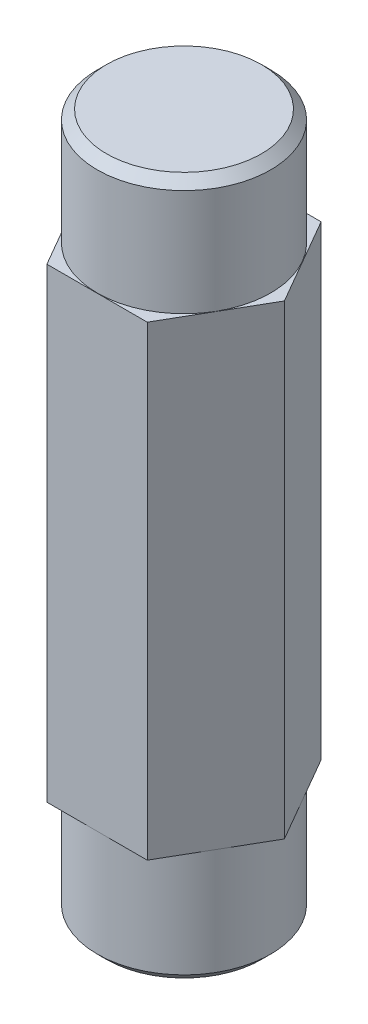
ISO-10303-21;
HEADER;
FILE_DESCRIPTION(('STEP AP214'),'2;1');
FILE_NAME('part.step','',(''),(''),'','','');
FILE_SCHEMA(('AUTOMOTIVE_DESIGN { 1 0 10303 214 1 1 1 1 }'));
ENDSEC;
DATA;
#1=APPLICATION_CONTEXT('core data for automotive mechanical design processes');
#2=APPLICATION_PROTOCOL_DEFINITION('international standard','automotive_design',2000,#1);
#3=PRODUCT_CONTEXT('',#1,'mechanical');
#4=PRODUCT('Part','Part','',(#3));
#5=PRODUCT_RELATED_PRODUCT_CATEGORY('part','',(#4));
#6=PRODUCT_DEFINITION_FORMATION('','',#4);
#7=PRODUCT_DEFINITION_CONTEXT('part definition',#1,'design');
#8=PRODUCT_DEFINITION('design','',#6,#7);
#9=PRODUCT_DEFINITION_SHAPE('','',#8);
#10=(LENGTH_UNIT() NAMED_UNIT(*) SI_UNIT(.MILLI.,.METRE.));
#11=(NAMED_UNIT(*) PLANE_ANGLE_UNIT() SI_UNIT($,.RADIAN.));
#12=(NAMED_UNIT(*) SI_UNIT($,.STERADIAN.) SOLID_ANGLE_UNIT());
#13=UNCERTAINTY_MEASURE_WITH_UNIT(LENGTH_MEASURE(1.E-05),#10,'distance_accuracy_value','');
#14=(GEOMETRIC_REPRESENTATION_CONTEXT(3) GLOBAL_UNCERTAINTY_ASSIGNED_CONTEXT((#13)) GLOBAL_UNIT_ASSIGNED_CONTEXT((#10,
#11,#12)) REPRESENTATION_CONTEXT('',''));
#15=CARTESIAN_POINT('',(0.,0.,0.));
#16=DIRECTION('',(0.,0.,1.));
#17=DIRECTION('',(1.,0.,0.));
#18=AXIS2_PLACEMENT_3D('',#15,#16,#17);
#19=CARTESIAN_POINT('',(-39.2241243202131,6.35,-16.6661167863655));
#20=DIRECTION('',(0.,-1.,0.));
#21=DIRECTION('',(0.,0.,-1.));
#22=AXIS2_PLACEMENT_3D('',#19,#20,#21);
#23=PLANE('',#22);
#24=CARTESIAN_POINT('',(-39.2241243202131,6.35000000039554,-16.6661167863655));
#25=DIRECTION('',(0.,-1.,0.));
#26=DIRECTION('',(0.,0.,-1.));
#27=AXIS2_PLACEMENT_3D('',#24,#25,#26);
#28=CIRCLE('',#27,4.24180000045985);
#29=CARTESIAN_POINT('',(-39.2241243202131,6.35000000039554,-20.9079167868254));
#30=VERTEX_POINT('',#29);
#31=EDGE_CURVE('E20',#30,#30,#28,.T.);
#32=ORIENTED_EDGE('',*,*,#31,.F.);
#33=EDGE_LOOP('',(#32));
#34=FACE_BOUND('',#33,.T.);
#35=ADVANCED_FACE('F17',(#34),#23,.F.);
#36=CARTESIAN_POINT('',(-39.2241243202131,5.84199999997281,-16.6661167863655));
#37=DIRECTION('',(0.,-1.,0.));
#38=DIRECTION('',(0.,0.,-1.));
#39=AXIS2_PLACEMENT_3D('',#36,#37,#38);
#40=CONICAL_SURFACE('',#39,4.74979999997309,0.785398162502276);
#41=ORIENTED_EDGE('',*,*,#31,.T.);
#42=EDGE_LOOP('',(#41));
#43=FACE_BOUND('',#42,.T.);
#44=CARTESIAN_POINT('',(-39.2241243202131,5.842,-16.6661167863655));
#45=DIRECTION('',(0.,1.,0.));
#46=DIRECTION('',(0.,0.,1.));
#47=AXIS2_PLACEMENT_3D('',#44,#45,#46);
#48=CIRCLE('',#47,4.7498);
#49=CARTESIAN_POINT('',(-39.2241243202131,5.842,-11.9163167863655));
#50=VERTEX_POINT('',#49);
#51=EDGE_CURVE('E97',#50,#50,#48,.F.);
#52=ORIENTED_EDGE('',*,*,#51,.F.);
#53=EDGE_LOOP('',(#52));
#54=FACE_BOUND('',#53,.T.);
#55=ADVANCED_FACE('F121',(#43,#54),#40,.T.);
#56=CARTESIAN_POINT('',(-39.2241243202131,6.35,-16.6661167863655));
#57=DIRECTION('',(0.,1.,0.));
#58=DIRECTION('',(0.,0.,1.));
#59=AXIS2_PLACEMENT_3D('',#56,#57,#58);
#60=CYLINDRICAL_SURFACE('',#59,4.7498);
#61=CARTESIAN_POINT('',(-39.2241243202131,0.,-16.6661167863655));
#62=DIRECTION('',(0.,1.,0.));
#63=DIRECTION('',(0.,0.,1.));
#64=AXIS2_PLACEMENT_3D('',#61,#62,#63);
#65=CIRCLE('',#64,4.7498);
#66=CARTESIAN_POINT('',(-39.2241243202131,0.,-11.9163167863655));
#67=VERTEX_POINT('',#66);
#68=EDGE_CURVE('E86',#67,#67,#65,.T.);
#69=ORIENTED_EDGE('',*,*,#68,.T.);
#70=EDGE_LOOP('',(#69));
#71=FACE_BOUND('',#70,.T.);
#72=ORIENTED_EDGE('',*,*,#51,.T.);
#73=EDGE_LOOP('',(#72));
#74=FACE_BOUND('',#73,.T.);
#75=ADVANCED_FACE('F108',(#71,#74),#60,.T.);
#76=CARTESIAN_POINT('',(-44.7233856342443,0.,-16.6661167863655));
#77=DIRECTION('',(0.,-1.,0.));
#78=DIRECTION('',(0.,0.,-1.));
#79=AXIS2_PLACEMENT_3D('',#76,#77,#78);
#80=PLANE('',#79);
#81=ORIENTED_EDGE('',*,*,#68,.F.);
#82=EDGE_LOOP('',(#81));
#83=FACE_BOUND('',#82,.T.);
#84=DIRECTION('',(1.,0.,0.));
#85=VECTOR('',#84,1.);
#86=CARTESIAN_POINT('',(-41.9737549772287,0.,-11.9036167863655));
#87=LINE('',#86,#85);
#88=CARTESIAN_POINT('',(-36.4744936631975,0.,-11.9036167863655));
#89=VERTEX_POINT('',#88);
#90=CARTESIAN_POINT('',(-41.9737549772287,0.,-11.9036167863655));
#91=VERTEX_POINT('',#90);
#92=EDGE_CURVE('E270',#89,#91,#87,.F.);
#93=ORIENTED_EDGE('',*,*,#92,.F.);
#94=DIRECTION('',(0.500000000000001,0.,-0.866025403784438));
#95=VECTOR('',#94,1.);
#96=CARTESIAN_POINT('',(-36.4744936631975,0.,-11.9036167863655));
#97=LINE('',#96,#95);
#98=CARTESIAN_POINT('',(-33.7248630061819,0.,-16.6661167863655));
#99=VERTEX_POINT('',#98);
#100=EDGE_CURVE('E275',#99,#89,#97,.F.);
#101=ORIENTED_EDGE('',*,*,#100,.F.);
#102=DIRECTION('',(-0.5,0.,-0.866025403784439));
#103=VECTOR('',#102,1.);
#104=CARTESIAN_POINT('',(-33.7248630061819,0.,-16.6661167863655));
#105=LINE('',#104,#103);
#106=CARTESIAN_POINT('',(-36.4744936631975,0.,-21.4286167863655));
#107=VERTEX_POINT('',#106);
#108=EDGE_CURVE('E278',#107,#99,#105,.F.);
#109=ORIENTED_EDGE('',*,*,#108,.F.);
#110=DIRECTION('',(-1.,0.,0.));
#111=VECTOR('',#110,1.);
#112=CARTESIAN_POINT('',(-36.4744936631975,0.,-21.4286167863655));
#113=LINE('',#112,#111);
#114=CARTESIAN_POINT('',(-41.9737549772287,0.,-21.4286167863655));
#115=VERTEX_POINT('',#114);
#116=EDGE_CURVE('E68',#115,#107,#113,.F.);
#117=ORIENTED_EDGE('',*,*,#116,.F.);
#118=DIRECTION('',(-0.500000000000001,0.,0.866025403784438));
#119=VECTOR('',#118,1.);
#120=CARTESIAN_POINT('',(-41.9737549772287,0.,-21.4286167863655));
#121=LINE('',#120,#119);
#122=CARTESIAN_POINT('',(-44.7233856342443,0.,-16.6661167863655));
#123=VERTEX_POINT('',#122);
#124=EDGE_CURVE('E70',#123,#115,#121,.F.);
#125=ORIENTED_EDGE('',*,*,#124,.F.);
#126=DIRECTION('',(0.5,0.,0.866025403784439));
#127=VECTOR('',#126,1.);
#128=CARTESIAN_POINT('',(-44.7233856342443,0.,-16.6661167863655));
#129=LINE('',#128,#127);
#130=EDGE_CURVE('E73',#91,#123,#129,.F.);
#131=ORIENTED_EDGE('',*,*,#130,.F.);
#132=EDGE_LOOP('',(#93,#101,#109,#117,#125,#131));
#133=FACE_BOUND('',#132,.T.);
#134=ADVANCED_FACE('F72',(#83,#133),#80,.F.);
#135=CARTESIAN_POINT('',(-39.2241243202131,-31.877,-16.6661167863655));
#136=DIRECTION('',(0.,1.,0.));
#137=DIRECTION('',(0.,0.,1.));
#138=AXIS2_PLACEMENT_3D('',#135,#136,#137);
#139=PLANE('',#138);
#140=CARTESIAN_POINT('',(-39.2241243202131,-31.8770000004633,-16.6661167863655));
#141=DIRECTION('',(0.,1.,0.));
#142=DIRECTION('',(0.,0.,1.));
#143=AXIS2_PLACEMENT_3D('',#140,#141,#142);
#144=CIRCLE('',#143,4.24180000042647);
#145=CARTESIAN_POINT('',(-39.2241243202131,-31.8770000004633,-12.424316785939));
#146=VERTEX_POINT('',#145);
#147=EDGE_CURVE('E102',#146,#146,#144,.T.);
#148=ORIENTED_EDGE('',*,*,#147,.F.);
#149=EDGE_LOOP('',(#148));
#150=FACE_BOUND('',#149,.T.);
#151=ADVANCED_FACE('F112',(#150),#139,.F.);
#152=CARTESIAN_POINT('',(-44.7233856342443,-25.527,-16.6661167863655));
#153=DIRECTION('',(-0.866025403784439,0.,0.5));
#154=DIRECTION('',(0.5,0.,0.866025403784439));
#155=AXIS2_PLACEMENT_3D('',#152,#153,#154);
#156=PLANE('',#155);
#157=DIRECTION('',(-0.500000000000002,0.,-0.866025403784438));
#158=VECTOR('',#157,1.);
#159=CARTESIAN_POINT('',(-41.9737549772287,-25.527,-11.9036167863655));
#160=LINE('',#159,#158);
#161=CARTESIAN_POINT('',(-41.9737549772287,-25.527,-11.9036167863655));
#162=VERTEX_POINT('',#161);
#163=CARTESIAN_POINT('',(-44.7233856342443,-25.527,-16.6661167863655));
#164=VERTEX_POINT('',#163);
#165=EDGE_CURVE('E104',#162,#164,#160,.T.);
#166=ORIENTED_EDGE('',*,*,#165,.F.);
#167=DIRECTION('',(0.,1.,0.));
#168=VECTOR('',#167,1.);
#169=CARTESIAN_POINT('',(-41.9737549772287,-25.527,-11.9036167863655));
#170=LINE('',#169,#168);
#171=EDGE_CURVE('E84',#91,#162,#170,.F.);
#172=ORIENTED_EDGE('',*,*,#171,.F.);
#173=ORIENTED_EDGE('',*,*,#130,.T.);
#174=DIRECTION('',(0.,1.,0.));
#175=VECTOR('',#174,1.);
#176=CARTESIAN_POINT('',(-44.7233856342443,-25.527,-16.6661167863655));
#177=LINE('',#176,#175);
#178=EDGE_CURVE('E78',#164,#123,#177,.T.);
#179=ORIENTED_EDGE('',*,*,#178,.F.);
#180=EDGE_LOOP('',(#166,#172,#173,#179));
#181=FACE_BOUND('',#180,.T.);
#182=ADVANCED_FACE('F81',(#181),#156,.T.);
#183=CARTESIAN_POINT('',(-41.9737549772287,-25.527,-21.4286167863655));
#184=DIRECTION('',(-0.866025403784438,0.,-0.500000000000001));
#185=DIRECTION('',(-0.500000000000001,0.,0.866025403784438));
#186=AXIS2_PLACEMENT_3D('',#183,#184,#185);
#187=PLANE('',#186);
#188=DIRECTION('',(0.500000000000001,0.,-0.866025403784438));
#189=VECTOR('',#188,1.);
#190=CARTESIAN_POINT('',(-44.7233856342443,-25.527,-16.6661167863655));
#191=LINE('',#190,#189);
#192=CARTESIAN_POINT('',(-41.9737549772287,-25.527,-21.4286167863655));
#193=VERTEX_POINT('',#192);
#194=EDGE_CURVE('E90',#164,#193,#191,.T.);
#195=ORIENTED_EDGE('',*,*,#194,.F.);
#196=ORIENTED_EDGE('',*,*,#178,.T.);
#197=ORIENTED_EDGE('',*,*,#124,.T.);
#198=DIRECTION('',(0.,1.,0.));
#199=VECTOR('',#198,1.);
#200=CARTESIAN_POINT('',(-41.9737549772287,-25.527,-21.4286167863655));
#201=LINE('',#200,#199);
#202=EDGE_CURVE('E93',#193,#115,#201,.T.);
#203=ORIENTED_EDGE('',*,*,#202,.F.);
#204=EDGE_LOOP('',(#195,#196,#197,#203));
#205=FACE_BOUND('',#204,.T.);
#206=ADVANCED_FACE('F88',(#205),#187,.T.);
#207=CARTESIAN_POINT('',(-36.4744936631975,-25.527,-21.4286167863655));
#208=DIRECTION('',(0.,0.,-1.));
#209=DIRECTION('',(-1.,0.,0.));
#210=AXIS2_PLACEMENT_3D('',#207,#208,#209);
#211=PLANE('',#210);
#212=DIRECTION('',(1.,0.,0.));
#213=VECTOR('',#212,1.);
#214=CARTESIAN_POINT('',(-44.7233856342443,-25.527,-21.4286167863655));
#215=LINE('',#214,#213);
#216=CARTESIAN_POINT('',(-36.4744936631975,-25.527,-21.4286167863655));
#217=VERTEX_POINT('',#216);
#218=EDGE_CURVE('E254',#193,#217,#215,.T.);
#219=ORIENTED_EDGE('',*,*,#218,.F.);
#220=ORIENTED_EDGE('',*,*,#202,.T.);
#221=ORIENTED_EDGE('',*,*,#116,.T.);
#222=DIRECTION('',(0.,1.,0.));
#223=VECTOR('',#222,1.);
#224=CARTESIAN_POINT('',(-36.4744936631975,-25.527,-21.4286167863655));
#225=LINE('',#224,#223);
#226=EDGE_CURVE('E256',#217,#107,#225,.T.);
#227=ORIENTED_EDGE('',*,*,#226,.F.);
#228=EDGE_LOOP('',(#219,#220,#221,#227));
#229=FACE_BOUND('',#228,.T.);
#230=ADVANCED_FACE('F149',(#229),#211,.T.);
#231=CARTESIAN_POINT('',(-33.7248630061819,-25.527,-16.6661167863655));
#232=DIRECTION('',(0.866025403784439,0.,-0.5));
#233=DIRECTION('',(-0.5,0.,-0.866025403784439));
#234=AXIS2_PLACEMENT_3D('',#231,#232,#233);
#235=PLANE('',#234);
#236=DIRECTION('',(0.5,0.,0.866025403784438));
#237=VECTOR('',#236,1.);
#238=CARTESIAN_POINT('',(-36.4744936631975,-25.527,-21.4286167863655));
#239=LINE('',#238,#237);
#240=CARTESIAN_POINT('',(-33.7248630061819,-25.527,-16.6661167863655));
#241=VERTEX_POINT('',#240);
#242=EDGE_CURVE('E260',#217,#241,#239,.T.);
#243=ORIENTED_EDGE('',*,*,#242,.F.);
#244=ORIENTED_EDGE('',*,*,#226,.T.);
#245=ORIENTED_EDGE('',*,*,#108,.T.);
#246=DIRECTION('',(0.,1.,0.));
#247=VECTOR('',#246,1.);
#248=CARTESIAN_POINT('',(-33.7248630061819,-25.527,-16.6661167863655));
#249=LINE('',#248,#247);
#250=EDGE_CURVE('E272',#241,#99,#249,.T.);
#251=ORIENTED_EDGE('',*,*,#250,.F.);
#252=EDGE_LOOP('',(#243,#244,#245,#251));
#253=FACE_BOUND('',#252,.T.);
#254=ADVANCED_FACE('F146',(#253),#235,.T.);
#255=CARTESIAN_POINT('',(-36.4744936631975,-25.527,-11.9036167863655));
#256=DIRECTION('',(0.866025403784438,0.,0.500000000000001));
#257=DIRECTION('',(0.500000000000001,0.,-0.866025403784438));
#258=AXIS2_PLACEMENT_3D('',#255,#256,#257);
#259=PLANE('',#258);
#260=DIRECTION('',(-0.500000000000001,0.,0.866025403784438));
#261=VECTOR('',#260,1.);
#262=CARTESIAN_POINT('',(-33.7248630061819,-25.527,-16.6661167863655));
#263=LINE('',#262,#261);
#264=CARTESIAN_POINT('',(-36.4744936631975,-25.527,-11.9036167863655));
#265=VERTEX_POINT('',#264);
#266=EDGE_CURVE('E280',#241,#265,#263,.T.);
#267=ORIENTED_EDGE('',*,*,#266,.F.);
#268=ORIENTED_EDGE('',*,*,#250,.T.);
#269=ORIENTED_EDGE('',*,*,#100,.T.);
#270=DIRECTION('',(0.,1.,0.));
#271=VECTOR('',#270,1.);
#272=CARTESIAN_POINT('',(-36.4744936631975,-25.527,-11.9036167863655));
#273=LINE('',#272,#271);
#274=EDGE_CURVE('E35',#265,#89,#273,.T.);
#275=ORIENTED_EDGE('',*,*,#274,.F.);
#276=EDGE_LOOP('',(#267,#268,#269,#275));
#277=FACE_BOUND('',#276,.T.);
#278=ADVANCED_FACE('F142',(#277),#259,.T.);
#279=CARTESIAN_POINT('',(-41.9737549772287,-25.527,-11.9036167863655));
#280=DIRECTION('',(0.,0.,1.));
#281=DIRECTION('',(1.,0.,0.));
#282=AXIS2_PLACEMENT_3D('',#279,#280,#281);
#283=PLANE('',#282);
#284=DIRECTION('',(1.,0.,0.));
#285=VECTOR('',#284,1.);
#286=CARTESIAN_POINT('',(-44.7233856342443,-25.527,-11.9036167863655));
#287=LINE('',#286,#285);
#288=EDGE_CURVE('E281',#265,#162,#287,.F.);
#289=ORIENTED_EDGE('',*,*,#288,.F.);
#290=ORIENTED_EDGE('',*,*,#274,.T.);
#291=ORIENTED_EDGE('',*,*,#92,.T.);
#292=ORIENTED_EDGE('',*,*,#171,.T.);
#293=EDGE_LOOP('',(#289,#290,#291,#292));
#294=FACE_BOUND('',#293,.T.);
#295=ADVANCED_FACE('F138',(#294),#283,.T.);
#296=CARTESIAN_POINT('',(-39.2241243202131,-31.3690000000975,-16.6661167863655));
#297=DIRECTION('',(0.,1.,0.));
#298=DIRECTION('',(0.,0.,1.));
#299=AXIS2_PLACEMENT_3D('',#296,#297,#298);
#300=CONICAL_SURFACE('',#299,4.74979999988286,0.785398162502276);
#301=ORIENTED_EDGE('',*,*,#147,.T.);
#302=EDGE_LOOP('',(#301));
#303=FACE_BOUND('',#302,.T.);
#304=CARTESIAN_POINT('',(-39.2241243202131,-31.369,-16.6661167863655));
#305=DIRECTION('',(0.,-1.,0.));
#306=DIRECTION('',(0.,0.,-1.));
#307=AXIS2_PLACEMENT_3D('',#304,#305,#306);
#308=CIRCLE('',#307,4.7498);
#309=CARTESIAN_POINT('',(-39.2241243202131,-31.369,-21.4159167863655));
#310=VERTEX_POINT('',#309);
#311=EDGE_CURVE('E26',#310,#310,#308,.F.);
#312=ORIENTED_EDGE('',*,*,#311,.F.);
#313=EDGE_LOOP('',(#312));
#314=FACE_BOUND('',#313,.T.);
#315=ADVANCED_FACE('F131',(#303,#314),#300,.T.);
#316=CARTESIAN_POINT('',(-44.7233856342443,-25.527,-16.6661167863655));
#317=DIRECTION('',(0.,-1.,0.));
#318=DIRECTION('',(0.,0.,-1.));
#319=AXIS2_PLACEMENT_3D('',#316,#317,#318);
#320=PLANE('',#319);
#321=CARTESIAN_POINT('',(-39.2241243202131,-25.527,-16.6661167863655));
#322=DIRECTION('',(0.,-1.,0.));
#323=DIRECTION('',(0.,0.,-1.));
#324=AXIS2_PLACEMENT_3D('',#321,#322,#323);
#325=CIRCLE('',#324,4.7498);
#326=CARTESIAN_POINT('',(-39.2241243202131,-25.527,-21.4159167863655));
#327=VERTEX_POINT('',#326);
#328=EDGE_CURVE('E11',#327,#327,#325,.T.);
#329=ORIENTED_EDGE('',*,*,#328,.F.);
#330=EDGE_LOOP('',(#329));
#331=FACE_BOUND('',#330,.T.);
#332=ORIENTED_EDGE('',*,*,#266,.T.);
#333=ORIENTED_EDGE('',*,*,#288,.T.);
#334=ORIENTED_EDGE('',*,*,#165,.T.);
#335=ORIENTED_EDGE('',*,*,#194,.T.);
#336=ORIENTED_EDGE('',*,*,#218,.T.);
#337=ORIENTED_EDGE('',*,*,#242,.T.);
#338=EDGE_LOOP('',(#332,#333,#334,#335,#336,#337));
#339=FACE_BOUND('',#338,.T.);
#340=ADVANCED_FACE('F125',(#331,#339),#320,.T.);
#341=CARTESIAN_POINT('',(-39.2241243202131,-31.877,-16.6661167863655));
#342=DIRECTION('',(0.,-1.,0.));
#343=DIRECTION('',(0.,0.,-1.));
#344=AXIS2_PLACEMENT_3D('',#341,#342,#343);
#345=CYLINDRICAL_SURFACE('',#344,4.7498);
#346=ORIENTED_EDGE('',*,*,#328,.T.);
#347=EDGE_LOOP('',(#346));
#348=FACE_BOUND('',#347,.T.);
#349=ORIENTED_EDGE('',*,*,#311,.T.);
#350=EDGE_LOOP('',(#349));
#351=FACE_BOUND('',#350,.T.);
#352=ADVANCED_FACE('F123',(#348,#351),#345,.T.);
#353=CLOSED_SHELL('',(#35,#55,#75,#134,#151,#182,#206,#230,#254,#278,#295,#315,#340,#352));
#354=MANIFOLD_SOLID_BREP('B1',#353);
#355=ADVANCED_BREP_SHAPE_REPRESENTATION('',(#18,#354),#14);
#356=SHAPE_DEFINITION_REPRESENTATION(#9,#355);
ENDSEC;
END-ISO-10303-21;
